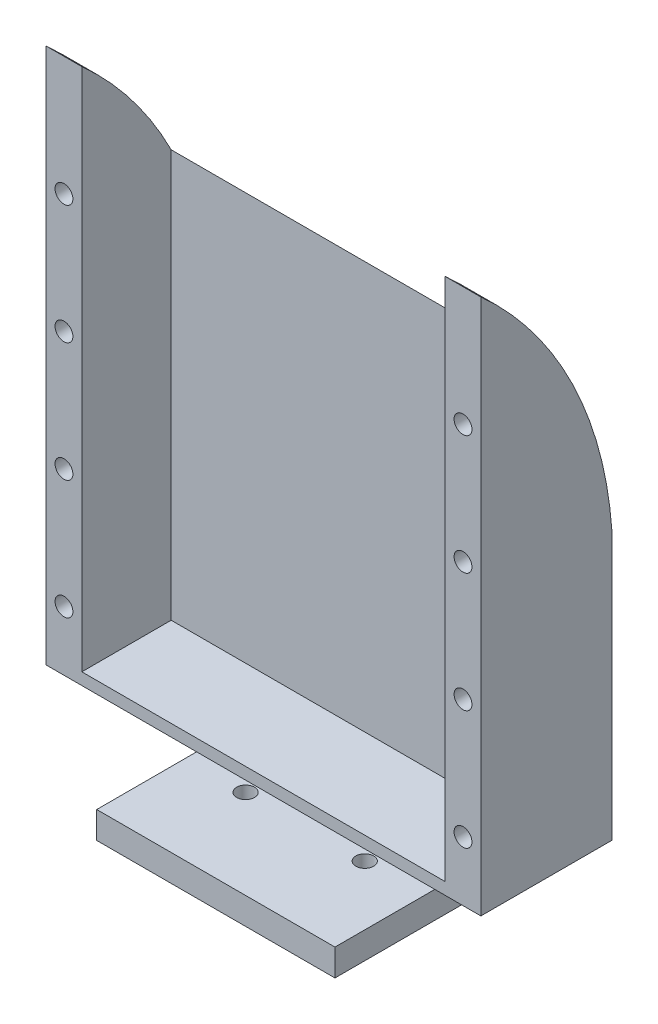
ISO-10303-21;
HEADER;
FILE_DESCRIPTION(('STEP AP214'),'2;1');
FILE_NAME('part.step','',(''),(''),'','','');
FILE_SCHEMA(('AUTOMOTIVE_DESIGN { 1 0 10303 214 1 1 1 1 }'));
ENDSEC;
DATA;
#1=APPLICATION_CONTEXT('core data for automotive mechanical design processes');
#2=APPLICATION_PROTOCOL_DEFINITION('international standard','automotive_design',2000,#1);
#3=PRODUCT_CONTEXT('',#1,'mechanical');
#4=PRODUCT('Part','Part','',(#3));
#5=PRODUCT_RELATED_PRODUCT_CATEGORY('part','',(#4));
#6=PRODUCT_DEFINITION_FORMATION('','',#4);
#7=PRODUCT_DEFINITION_CONTEXT('part definition',#1,'design');
#8=PRODUCT_DEFINITION('design','',#6,#7);
#9=PRODUCT_DEFINITION_SHAPE('','',#8);
#10=(LENGTH_UNIT() NAMED_UNIT(*) SI_UNIT(.MILLI.,.METRE.));
#11=(NAMED_UNIT(*) PLANE_ANGLE_UNIT() SI_UNIT($,.RADIAN.));
#12=(NAMED_UNIT(*) SI_UNIT($,.STERADIAN.) SOLID_ANGLE_UNIT());
#13=UNCERTAINTY_MEASURE_WITH_UNIT(LENGTH_MEASURE(1.E-05),#10,'distance_accuracy_value','');
#14=(GEOMETRIC_REPRESENTATION_CONTEXT(3) GLOBAL_UNCERTAINTY_ASSIGNED_CONTEXT((#13)) GLOBAL_UNIT_ASSIGNED_CONTEXT((#10,
#11,#12)) REPRESENTATION_CONTEXT('',''));
#15=CARTESIAN_POINT('',(0.,0.,0.));
#16=DIRECTION('',(0.,0.,1.));
#17=DIRECTION('',(1.,0.,0.));
#18=AXIS2_PLACEMENT_3D('',#15,#16,#17);
#19=CARTESIAN_POINT('',(0.,0.,-8.));
#20=DIRECTION('',(0.,0.,1.));
#21=DIRECTION('',(1.,0.,0.));
#22=AXIS2_PLACEMENT_3D('',#19,#20,#21);
#23=PLANE('',#22);
#24=CARTESIAN_POINT('',(-10.,8.27,-8.));
#25=DIRECTION('',(0.,0.,1.));
#26=DIRECTION('',(1.,0.,0.));
#27=AXIS2_PLACEMENT_3D('',#24,#25,#26);
#28=CIRCLE('',#27,3.5);
#29=CARTESIAN_POINT('',(-6.5,8.27,-8.));
#30=VERTEX_POINT('',#29);
#31=EDGE_CURVE('E191',#30,#30,#28,.T.);
#32=ORIENTED_EDGE('',*,*,#31,.F.);
#33=EDGE_LOOP('',(#32));
#34=FACE_BOUND('',#33,.T.);
#35=CARTESIAN_POINT('',(10.,8.27,-8.));
#36=DIRECTION('',(0.,0.,1.));
#37=DIRECTION('',(1.,0.,0.));
#38=AXIS2_PLACEMENT_3D('',#35,#36,#37);
#39=CIRCLE('',#38,3.5);
#40=CARTESIAN_POINT('',(13.5,8.27,-8.));
#41=VERTEX_POINT('',#40);
#42=EDGE_CURVE('E186',#41,#41,#39,.T.);
#43=ORIENTED_EDGE('',*,*,#42,.F.);
#44=EDGE_LOOP('',(#43));
#45=FACE_BOUND('',#44,.T.);
#46=DIRECTION('',(0.,-1.,0.));
#47=VECTOR('',#46,1.);
#48=CARTESIAN_POINT('',(20.,4.5,-8.));
#49=LINE('',#48,#47);
#50=CARTESIAN_POINT('',(20.,13.27,-8.));
#51=VERTEX_POINT('',#50);
#52=CARTESIAN_POINT('',(20.,4.5,-8.));
#53=VERTEX_POINT('',#52);
#54=EDGE_CURVE('E207',#51,#53,#49,.T.);
#55=ORIENTED_EDGE('',*,*,#54,.F.);
#56=DIRECTION('',(-1.,0.,0.));
#57=VECTOR('',#56,1.);
#58=CARTESIAN_POINT('',(0.,13.27,-8.));
#59=LINE('',#58,#57);
#60=CARTESIAN_POINT('',(-20.,13.27,-8.));
#61=VERTEX_POINT('',#60);
#62=EDGE_CURVE('E11',#51,#61,#59,.T.);
#63=ORIENTED_EDGE('',*,*,#62,.T.);
#64=DIRECTION('',(0.,1.,0.));
#65=VECTOR('',#64,1.);
#66=CARTESIAN_POINT('',(-20.,4.5,-8.));
#67=LINE('',#66,#65);
#68=CARTESIAN_POINT('',(-20.,4.5,-7.99999999999999));
#69=VERTEX_POINT('',#68);
#70=EDGE_CURVE('E56',#69,#61,#67,.T.);
#71=ORIENTED_EDGE('',*,*,#70,.F.);
#72=DIRECTION('',(-1.,0.,0.));
#73=VECTOR('',#72,1.);
#74=CARTESIAN_POINT('',(20.,4.5,-8.));
#75=LINE('',#74,#73);
#76=EDGE_CURVE('E210',#53,#69,#75,.T.);
#77=ORIENTED_EDGE('',*,*,#76,.F.);
#78=EDGE_LOOP('',(#55,#63,#71,#77));
#79=FACE_BOUND('',#78,.T.);
#80=ADVANCED_FACE('F34',(#34,#45,#79),#23,.T.);
#81=DIRECTION('',(-1.,0.,0.));
#82=VECTOR('',#81,1.);
#83=CARTESIAN_POINT('',(36.5,83.6840511230822,-8.));
#84=LINE('',#83,#82);
#85=CARTESIAN_POINT('',(-30.5,83.6840511230822,-8.));
#86=VERTEX_POINT('',#85);
#87=CARTESIAN_POINT('',(30.5,83.6840511230822,-8.));
#88=VERTEX_POINT('',#87);
#89=EDGE_CURVE('E398',#86,#88,#84,.F.);
#90=ORIENTED_EDGE('',*,*,#89,.F.);
#91=DIRECTION('',(0.,1.,0.));
#92=VECTOR('',#91,1.);
#93=CARTESIAN_POINT('',(-30.5,103.27,-8.));
#94=LINE('',#93,#92);
#95=CARTESIAN_POINT('',(-30.5,15.27,-8.));
#96=VERTEX_POINT('',#95);
#97=EDGE_CURVE('E179',#96,#86,#94,.T.);
#98=ORIENTED_EDGE('',*,*,#97,.F.);
#99=DIRECTION('',(-1.,0.,0.));
#100=VECTOR('',#99,1.);
#101=CARTESIAN_POINT('',(-30.5,15.27,-8.));
#102=LINE('',#101,#100);
#103=CARTESIAN_POINT('',(30.5,15.27,-8.));
#104=VERTEX_POINT('',#103);
#105=EDGE_CURVE('E176',#104,#96,#102,.T.);
#106=ORIENTED_EDGE('',*,*,#105,.F.);
#107=DIRECTION('',(0.,-1.,0.));
#108=VECTOR('',#107,1.);
#109=CARTESIAN_POINT('',(30.5,103.27,-8.));
#110=LINE('',#109,#108);
#111=EDGE_CURVE('E174',#88,#104,#110,.T.);
#112=ORIENTED_EDGE('',*,*,#111,.F.);
#113=EDGE_LOOP('',(#90,#98,#106,#112));
#114=FACE_BOUND('',#113,.T.);
#115=ADVANCED_FACE('F280',(#114),#23,.T.);
#116=CARTESIAN_POINT('',(10.,8.27,-8.));
#117=DIRECTION('',(0.,0.,-1.));
#118=DIRECTION('',(-1.,0.,0.));
#119=AXIS2_PLACEMENT_3D('',#116,#117,#118);
#120=CYLINDRICAL_SURFACE('',#119,1.5);
#121=CARTESIAN_POINT('',(10.,8.27,-15.));
#122=DIRECTION('',(0.,0.,-1.));
#123=DIRECTION('',(-1.,0.,0.));
#124=AXIS2_PLACEMENT_3D('',#121,#122,#123);
#125=CIRCLE('',#124,1.5);
#126=CARTESIAN_POINT('',(8.5,8.27,-15.));
#127=VERTEX_POINT('',#126);
#128=EDGE_CURVE('E202',#127,#127,#125,.T.);
#129=ORIENTED_EDGE('',*,*,#128,.T.);
#130=EDGE_LOOP('',(#129));
#131=FACE_BOUND('',#130,.T.);
#132=CARTESIAN_POINT('',(10.,8.27,-11.));
#133=DIRECTION('',(0.,0.,1.));
#134=DIRECTION('',(1.,0.,0.));
#135=AXIS2_PLACEMENT_3D('',#132,#133,#134);
#136=CIRCLE('',#135,1.5);
#137=CARTESIAN_POINT('',(11.5,8.27,-11.));
#138=VERTEX_POINT('',#137);
#139=EDGE_CURVE('E203',#138,#138,#136,.F.);
#140=ORIENTED_EDGE('',*,*,#139,.F.);
#141=EDGE_LOOP('',(#140));
#142=FACE_BOUND('',#141,.T.);
#143=ADVANCED_FACE('F277',(#131,#142),#120,.F.);
#144=CARTESIAN_POINT('',(-10.,8.27,-8.));
#145=DIRECTION('',(0.,0.,-1.));
#146=DIRECTION('',(-1.,0.,0.));
#147=AXIS2_PLACEMENT_3D('',#144,#145,#146);
#148=CYLINDRICAL_SURFACE('',#147,1.5);
#149=CARTESIAN_POINT('',(-10.,8.27,-15.));
#150=DIRECTION('',(0.,0.,-1.));
#151=DIRECTION('',(-1.,0.,0.));
#152=AXIS2_PLACEMENT_3D('',#149,#150,#151);
#153=CIRCLE('',#152,1.5);
#154=CARTESIAN_POINT('',(-11.5,8.27,-15.));
#155=VERTEX_POINT('',#154);
#156=EDGE_CURVE('E199',#155,#155,#153,.T.);
#157=ORIENTED_EDGE('',*,*,#156,.T.);
#158=EDGE_LOOP('',(#157));
#159=FACE_BOUND('',#158,.T.);
#160=CARTESIAN_POINT('',(-10.,8.27,-11.));
#161=DIRECTION('',(0.,0.,1.));
#162=DIRECTION('',(1.,0.,0.));
#163=AXIS2_PLACEMENT_3D('',#160,#161,#162);
#164=CIRCLE('',#163,1.5);
#165=CARTESIAN_POINT('',(-8.5,8.27,-11.));
#166=VERTEX_POINT('',#165);
#167=EDGE_CURVE('E190',#166,#166,#164,.F.);
#168=ORIENTED_EDGE('',*,*,#167,.F.);
#169=EDGE_LOOP('',(#168));
#170=FACE_BOUND('',#169,.T.);
#171=ADVANCED_FACE('F279',(#159,#170),#148,.F.);
#172=CARTESIAN_POINT('',(0.,4.5,0.));
#173=DIRECTION('',(0.,-1.,0.));
#174=DIRECTION('',(0.,0.,-1.));
#175=AXIS2_PLACEMENT_3D('',#172,#173,#174);
#176=PLANE('',#175);
#177=DIRECTION('',(0.,0.,-1.));
#178=VECTOR('',#177,1.);
#179=CARTESIAN_POINT('',(20.,4.5,15.));
#180=LINE('',#179,#178);
#181=CARTESIAN_POINT('',(20.,4.5,15.));
#182=VERTEX_POINT('',#181);
#183=EDGE_CURVE('E245',#182,#53,#180,.T.);
#184=ORIENTED_EDGE('',*,*,#183,.T.);
#185=ORIENTED_EDGE('',*,*,#76,.T.);
#186=DIRECTION('',(0.,0.,1.));
#187=VECTOR('',#186,1.);
#188=CARTESIAN_POINT('',(-20.,4.5,15.));
#189=LINE('',#188,#187);
#190=CARTESIAN_POINT('',(-20.,4.5,15.));
#191=VERTEX_POINT('',#190);
#192=EDGE_CURVE('E248',#69,#191,#189,.T.);
#193=ORIENTED_EDGE('',*,*,#192,.T.);
#194=DIRECTION('',(1.,0.,0.));
#195=VECTOR('',#194,1.);
#196=CARTESIAN_POINT('',(-20.,4.5,15.));
#197=LINE('',#196,#195);
#198=EDGE_CURVE('E251',#191,#182,#197,.T.);
#199=ORIENTED_EDGE('',*,*,#198,.T.);
#200=EDGE_LOOP('',(#184,#185,#193,#199));
#201=FACE_BOUND('',#200,.T.);
#202=CARTESIAN_POINT('',(-10.,4.5,0.));
#203=DIRECTION('',(0.,1.,0.));
#204=DIRECTION('',(0.,0.,1.));
#205=AXIS2_PLACEMENT_3D('',#202,#203,#204);
#206=CIRCLE('',#205,1.5);
#207=CARTESIAN_POINT('',(-10.,4.5,1.5));
#208=VERTEX_POINT('',#207);
#209=EDGE_CURVE('E239',#208,#208,#206,.T.);
#210=ORIENTED_EDGE('',*,*,#209,.F.);
#211=EDGE_LOOP('',(#210));
#212=FACE_BOUND('',#211,.T.);
#213=CARTESIAN_POINT('',(9.99999999999999,4.5,0.));
#214=DIRECTION('',(0.,1.,0.));
#215=DIRECTION('',(0.,0.,1.));
#216=AXIS2_PLACEMENT_3D('',#213,#214,#215);
#217=CIRCLE('',#216,1.5);
#218=CARTESIAN_POINT('',(9.99999999999999,4.5,1.5));
#219=VERTEX_POINT('',#218);
#220=EDGE_CURVE('E233',#219,#219,#217,.T.);
#221=ORIENTED_EDGE('',*,*,#220,.F.);
#222=EDGE_LOOP('',(#221));
#223=FACE_BOUND('',#222,.T.);
#224=ADVANCED_FACE('F287',(#201,#212,#223),#176,.F.);
#225=CARTESIAN_POINT('',(0.,0.,0.));
#226=DIRECTION('',(0.,-1.,0.));
#227=DIRECTION('',(0.,0.,-1.));
#228=AXIS2_PLACEMENT_3D('',#225,#226,#227);
#229=PLANE('',#228);
#230=CARTESIAN_POINT('',(-10.,0.,0.));
#231=DIRECTION('',(0.,1.,0.));
#232=DIRECTION('',(0.,0.,1.));
#233=AXIS2_PLACEMENT_3D('',#230,#231,#232);
#234=CIRCLE('',#233,1.5);
#235=CARTESIAN_POINT('',(-10.,0.,1.5));
#236=VERTEX_POINT('',#235);
#237=EDGE_CURVE('E236',#236,#236,#234,.T.);
#238=ORIENTED_EDGE('',*,*,#237,.T.);
#239=EDGE_LOOP('',(#238));
#240=FACE_BOUND('',#239,.T.);
#241=DIRECTION('',(0.,0.,-1.));
#242=VECTOR('',#241,1.);
#243=CARTESIAN_POINT('',(20.,0.,15.));
#244=LINE('',#243,#242);
#245=CARTESIAN_POINT('',(20.,0.,15.));
#246=VERTEX_POINT('',#245);
#247=CARTESIAN_POINT('',(20.,0.,-15.));
#248=VERTEX_POINT('',#247);
#249=EDGE_CURVE('E242',#246,#248,#244,.T.);
#250=ORIENTED_EDGE('',*,*,#249,.F.);
#251=DIRECTION('',(1.,0.,0.));
#252=VECTOR('',#251,1.);
#253=CARTESIAN_POINT('',(-20.,0.,15.));
#254=LINE('',#253,#252);
#255=CARTESIAN_POINT('',(-20.,0.,15.));
#256=VERTEX_POINT('',#255);
#257=EDGE_CURVE('E249',#256,#246,#254,.T.);
#258=ORIENTED_EDGE('',*,*,#257,.F.);
#259=DIRECTION('',(0.,0.,1.));
#260=VECTOR('',#259,1.);
#261=CARTESIAN_POINT('',(-20.,0.,15.));
#262=LINE('',#261,#260);
#263=CARTESIAN_POINT('',(-20.,0.,-15.));
#264=VERTEX_POINT('',#263);
#265=EDGE_CURVE('E258',#264,#256,#262,.T.);
#266=ORIENTED_EDGE('',*,*,#265,.F.);
#267=DIRECTION('',(-1.,0.,0.));
#268=VECTOR('',#267,1.);
#269=CARTESIAN_POINT('',(-20.,0.,-15.));
#270=LINE('',#269,#268);
#271=EDGE_CURVE('E256',#248,#264,#270,.T.);
#272=ORIENTED_EDGE('',*,*,#271,.F.);
#273=EDGE_LOOP('',(#250,#258,#266,#272));
#274=FACE_BOUND('',#273,.T.);
#275=CARTESIAN_POINT('',(9.99999999999999,0.,0.));
#276=DIRECTION('',(0.,1.,0.));
#277=DIRECTION('',(0.,0.,1.));
#278=AXIS2_PLACEMENT_3D('',#275,#276,#277);
#279=CIRCLE('',#278,1.5);
#280=CARTESIAN_POINT('',(9.99999999999999,0.,1.5));
#281=VERTEX_POINT('',#280);
#282=EDGE_CURVE('E225',#281,#281,#279,.T.);
#283=ORIENTED_EDGE('',*,*,#282,.T.);
#284=EDGE_LOOP('',(#283));
#285=FACE_BOUND('',#284,.T.);
#286=ADVANCED_FACE('F321',(#240,#274,#285),#229,.T.);
#287=CARTESIAN_POINT('',(20.,4.5,15.));
#288=DIRECTION('',(-1.,0.,0.));
#289=DIRECTION('',(0.,0.,1.));
#290=AXIS2_PLACEMENT_3D('',#287,#288,#289);
#291=PLANE('',#290);
#292=ORIENTED_EDGE('',*,*,#249,.T.);
#293=DIRECTION('',(0.,-1.,0.));
#294=VECTOR('',#293,1.);
#295=CARTESIAN_POINT('',(20.,4.5,-15.));
#296=LINE('',#295,#294);
#297=CARTESIAN_POINT('',(20.,13.27,-15.));
#298=VERTEX_POINT('',#297);
#299=EDGE_CURVE('E42',#298,#248,#296,.T.);
#300=ORIENTED_EDGE('',*,*,#299,.F.);
#301=DIRECTION('',(0.,0.,-1.));
#302=VECTOR('',#301,1.);
#303=CARTESIAN_POINT('',(20.,13.27,-8.));
#304=LINE('',#303,#302);
#305=EDGE_CURVE('E229',#51,#298,#304,.T.);
#306=ORIENTED_EDGE('',*,*,#305,.F.);
#307=ORIENTED_EDGE('',*,*,#54,.T.);
#308=ORIENTED_EDGE('',*,*,#183,.F.);
#309=DIRECTION('',(0.,-1.,0.));
#310=VECTOR('',#309,1.);
#311=CARTESIAN_POINT('',(20.,4.5,15.));
#312=LINE('',#311,#310);
#313=EDGE_CURVE('E253',#182,#246,#312,.T.);
#314=ORIENTED_EDGE('',*,*,#313,.T.);
#315=EDGE_LOOP('',(#292,#300,#306,#307,#308,#314));
#316=FACE_BOUND('',#315,.T.);
#317=ADVANCED_FACE('F36',(#316),#291,.F.);
#318=CARTESIAN_POINT('',(-20.,4.5,-15.));
#319=DIRECTION('',(0.,0.,1.));
#320=DIRECTION('',(1.,0.,0.));
#321=AXIS2_PLACEMENT_3D('',#318,#319,#320);
#322=PLANE('',#321);
#323=DIRECTION('',(0.,1.,0.));
#324=VECTOR('',#323,1.);
#325=CARTESIAN_POINT('',(-36.5,13.27,-15.));
#326=LINE('',#325,#324);
#327=CARTESIAN_POINT('',(-36.5,13.27,-15.));
#328=VERTEX_POINT('',#327);
#329=CARTESIAN_POINT('',(-36.5,58.27,-15.));
#330=VERTEX_POINT('',#329);
#331=EDGE_CURVE('E206',#328,#330,#326,.T.);
#332=ORIENTED_EDGE('',*,*,#331,.T.);
#333=DIRECTION('',(-1.,0.,0.));
#334=VECTOR('',#333,1.);
#335=CARTESIAN_POINT('',(36.5,58.27,-15.));
#336=LINE('',#335,#334);
#337=CARTESIAN_POINT('',(36.5,58.27,-15.));
#338=VERTEX_POINT('',#337);
#339=EDGE_CURVE('E154',#338,#330,#336,.T.);
#340=ORIENTED_EDGE('',*,*,#339,.F.);
#341=DIRECTION('',(0.,-1.,0.));
#342=VECTOR('',#341,1.);
#343=CARTESIAN_POINT('',(36.5,13.27,-15.));
#344=LINE('',#343,#342);
#345=CARTESIAN_POINT('',(36.5,13.27,-15.));
#346=VERTEX_POINT('',#345);
#347=EDGE_CURVE('E153',#338,#346,#344,.T.);
#348=ORIENTED_EDGE('',*,*,#347,.T.);
#349=DIRECTION('',(-1.,0.,0.));
#350=VECTOR('',#349,1.);
#351=CARTESIAN_POINT('',(36.5,13.27,-15.));
#352=LINE('',#351,#350);
#353=EDGE_CURVE('E218',#346,#298,#352,.T.);
#354=ORIENTED_EDGE('',*,*,#353,.T.);
#355=ORIENTED_EDGE('',*,*,#299,.T.);
#356=ORIENTED_EDGE('',*,*,#271,.T.);
#357=DIRECTION('',(0.,-1.,0.));
#358=VECTOR('',#357,1.);
#359=CARTESIAN_POINT('',(-20.,4.5,-15.));
#360=LINE('',#359,#358);
#361=CARTESIAN_POINT('',(-20.,13.27,-15.));
#362=VERTEX_POINT('',#361);
#363=EDGE_CURVE('E266',#362,#264,#360,.T.);
#364=ORIENTED_EDGE('',*,*,#363,.F.);
#365=DIRECTION('',(-1.,0.,0.));
#366=VECTOR('',#365,1.);
#367=CARTESIAN_POINT('',(-20.,13.27,-15.));
#368=LINE('',#367,#366);
#369=EDGE_CURVE('E211',#362,#328,#368,.T.);
#370=ORIENTED_EDGE('',*,*,#369,.T.);
#371=EDGE_LOOP('',(#332,#340,#348,#354,#355,#356,#364,#370));
#372=FACE_BOUND('',#371,.T.);
#373=ORIENTED_EDGE('',*,*,#156,.F.);
#374=EDGE_LOOP('',(#373));
#375=FACE_BOUND('',#374,.T.);
#376=ORIENTED_EDGE('',*,*,#128,.F.);
#377=EDGE_LOOP('',(#376));
#378=FACE_BOUND('',#377,.T.);
#379=ADVANCED_FACE('F331',(#372,#375,#378),#322,.F.);
#380=CARTESIAN_POINT('',(-20.,4.5,15.));
#381=DIRECTION('',(1.,0.,0.));
#382=DIRECTION('',(0.,0.,-1.));
#383=AXIS2_PLACEMENT_3D('',#380,#381,#382);
#384=PLANE('',#383);
#385=ORIENTED_EDGE('',*,*,#265,.T.);
#386=DIRECTION('',(0.,-1.,0.));
#387=VECTOR('',#386,1.);
#388=CARTESIAN_POINT('',(-20.,4.5,15.));
#389=LINE('',#388,#387);
#390=EDGE_CURVE('E263',#191,#256,#389,.T.);
#391=ORIENTED_EDGE('',*,*,#390,.F.);
#392=ORIENTED_EDGE('',*,*,#192,.F.);
#393=ORIENTED_EDGE('',*,*,#70,.T.);
#394=DIRECTION('',(0.,0.,-1.));
#395=VECTOR('',#394,1.);
#396=CARTESIAN_POINT('',(-20.,13.27,-8.));
#397=LINE('',#396,#395);
#398=EDGE_CURVE('E226',#61,#362,#397,.T.);
#399=ORIENTED_EDGE('',*,*,#398,.T.);
#400=ORIENTED_EDGE('',*,*,#363,.T.);
#401=EDGE_LOOP('',(#385,#391,#392,#393,#399,#400));
#402=FACE_BOUND('',#401,.T.);
#403=ADVANCED_FACE('F328',(#402),#384,.F.);
#404=CARTESIAN_POINT('',(-20.,4.5,15.));
#405=DIRECTION('',(0.,0.,-1.));
#406=DIRECTION('',(-1.,0.,0.));
#407=AXIS2_PLACEMENT_3D('',#404,#405,#406);
#408=PLANE('',#407);
#409=ORIENTED_EDGE('',*,*,#257,.T.);
#410=ORIENTED_EDGE('',*,*,#313,.F.);
#411=ORIENTED_EDGE('',*,*,#198,.F.);
#412=ORIENTED_EDGE('',*,*,#390,.T.);
#413=EDGE_LOOP('',(#409,#410,#411,#412));
#414=FACE_BOUND('',#413,.T.);
#415=ADVANCED_FACE('F317',(#414),#408,.F.);
#416=CARTESIAN_POINT('',(-10.,4.5,0.));
#417=DIRECTION('',(0.,-1.,0.));
#418=DIRECTION('',(0.,0.,-1.));
#419=AXIS2_PLACEMENT_3D('',#416,#417,#418);
#420=CYLINDRICAL_SURFACE('',#419,1.5);
#421=ORIENTED_EDGE('',*,*,#209,.T.);
#422=EDGE_LOOP('',(#421));
#423=FACE_BOUND('',#422,.T.);
#424=ORIENTED_EDGE('',*,*,#237,.F.);
#425=EDGE_LOOP('',(#424));
#426=FACE_BOUND('',#425,.T.);
#427=ADVANCED_FACE('F313',(#423,#426),#420,.F.);
#428=CARTESIAN_POINT('',(9.99999999999999,4.5,0.));
#429=DIRECTION('',(0.,-1.,0.));
#430=DIRECTION('',(0.,0.,-1.));
#431=AXIS2_PLACEMENT_3D('',#428,#429,#430);
#432=CYLINDRICAL_SURFACE('',#431,1.5);
#433=ORIENTED_EDGE('',*,*,#220,.T.);
#434=EDGE_LOOP('',(#433));
#435=FACE_BOUND('',#434,.T.);
#436=ORIENTED_EDGE('',*,*,#282,.F.);
#437=EDGE_LOOP('',(#436));
#438=FACE_BOUND('',#437,.T.);
#439=ADVANCED_FACE('F309',(#435,#438),#432,.F.);
#440=CARTESIAN_POINT('',(-36.5,13.27,-8.));
#441=DIRECTION('',(-1.,0.,0.));
#442=DIRECTION('',(0.,0.,1.));
#443=AXIS2_PLACEMENT_3D('',#440,#441,#442);
#444=PLANE('',#443);
#445=CARTESIAN_POINT('',(-36.5,53.6086172597643,51.5573737868457));
#446=DIRECTION('',(1.,0.,0.));
#447=DIRECTION('',(0.,0.,1.));
#448=AXIS2_PLACEMENT_3D('',#445,#446,#447);
#449=CIRCLE('',#448,66.7204053828577);
#450=CARTESIAN_POINT('',(-36.5,103.27,7.));
#451=VERTEX_POINT('',#450);
#452=EDGE_CURVE('E155',#330,#451,#449,.T.);
#453=ORIENTED_EDGE('',*,*,#452,.F.);
#454=ORIENTED_EDGE('',*,*,#331,.F.);
#455=DIRECTION('',(0.,0.,-1.));
#456=VECTOR('',#455,1.);
#457=CARTESIAN_POINT('',(-36.5,13.27,-8.));
#458=LINE('',#457,#456);
#459=CARTESIAN_POINT('',(-36.5,13.27,7.));
#460=VERTEX_POINT('',#459);
#461=EDGE_CURVE('E223',#460,#328,#458,.T.);
#462=ORIENTED_EDGE('',*,*,#461,.F.);
#463=DIRECTION('',(0.,-1.,0.));
#464=VECTOR('',#463,1.);
#465=CARTESIAN_POINT('',(-36.5,103.27,7.));
#466=LINE('',#465,#464);
#467=EDGE_CURVE('E164',#451,#460,#466,.T.);
#468=ORIENTED_EDGE('',*,*,#467,.F.);
#469=EDGE_LOOP('',(#453,#454,#462,#468));
#470=FACE_BOUND('',#469,.T.);
#471=ADVANCED_FACE('F302',(#470),#444,.T.);
#472=CARTESIAN_POINT('',(-20.,13.27,-8.));
#473=DIRECTION('',(0.,-1.,0.));
#474=DIRECTION('',(1.,0.,0.));
#475=AXIS2_PLACEMENT_3D('',#472,#473,#474);
#476=PLANE('',#475);
#477=ORIENTED_EDGE('',*,*,#369,.F.);
#478=ORIENTED_EDGE('',*,*,#398,.F.);
#479=ORIENTED_EDGE('',*,*,#62,.F.);
#480=ORIENTED_EDGE('',*,*,#305,.T.);
#481=ORIENTED_EDGE('',*,*,#353,.F.);
#482=DIRECTION('',(0.,0.,-1.));
#483=VECTOR('',#482,1.);
#484=CARTESIAN_POINT('',(36.5,13.27,-8.));
#485=LINE('',#484,#483);
#486=CARTESIAN_POINT('',(36.5,13.27,7.));
#487=VERTEX_POINT('',#486);
#488=EDGE_CURVE('E214',#487,#346,#485,.T.);
#489=ORIENTED_EDGE('',*,*,#488,.F.);
#490=DIRECTION('',(1.,0.,0.));
#491=VECTOR('',#490,1.);
#492=CARTESIAN_POINT('',(-36.5,13.27,7.));
#493=LINE('',#492,#491);
#494=EDGE_CURVE('E162',#460,#487,#493,.T.);
#495=ORIENTED_EDGE('',*,*,#494,.F.);
#496=ORIENTED_EDGE('',*,*,#461,.T.);
#497=EDGE_LOOP('',(#477,#478,#479,#480,#481,#489,#495,#496));
#498=FACE_BOUND('',#497,.T.);
#499=ADVANCED_FACE('F299',(#498),#476,.T.);
#500=CARTESIAN_POINT('',(36.5,13.27,-8.));
#501=DIRECTION('',(1.,0.,0.));
#502=DIRECTION('',(0.,1.,0.));
#503=AXIS2_PLACEMENT_3D('',#500,#501,#502);
#504=PLANE('',#503);
#505=CARTESIAN_POINT('',(36.5,53.6086172597643,51.5573737868457));
#506=DIRECTION('',(1.,0.,0.));
#507=DIRECTION('',(0.,0.,1.));
#508=AXIS2_PLACEMENT_3D('',#505,#506,#507);
#509=CIRCLE('',#508,66.7204053828577);
#510=CARTESIAN_POINT('',(36.5,103.27,7.));
#511=VERTEX_POINT('',#510);
#512=EDGE_CURVE('E138',#338,#511,#509,.T.);
#513=ORIENTED_EDGE('',*,*,#512,.T.);
#514=DIRECTION('',(0.,1.,0.));
#515=VECTOR('',#514,1.);
#516=CARTESIAN_POINT('',(36.5,13.27,7.));
#517=LINE('',#516,#515);
#518=EDGE_CURVE('E146',#487,#511,#517,.T.);
#519=ORIENTED_EDGE('',*,*,#518,.F.);
#520=ORIENTED_EDGE('',*,*,#488,.T.);
#521=ORIENTED_EDGE('',*,*,#347,.F.);
#522=EDGE_LOOP('',(#513,#519,#520,#521));
#523=FACE_BOUND('',#522,.T.);
#524=ADVANCED_FACE('F151',(#523),#504,.T.);
#525=CARTESIAN_POINT('',(-10.,8.27,-11.));
#526=DIRECTION('',(0.,0.,1.));
#527=DIRECTION('',(1.,0.,0.));
#528=AXIS2_PLACEMENT_3D('',#525,#526,#527);
#529=PLANE('',#528);
#530=CARTESIAN_POINT('',(-10.,8.27,-11.));
#531=DIRECTION('',(0.,0.,1.));
#532=DIRECTION('',(1.,0.,0.));
#533=AXIS2_PLACEMENT_3D('',#530,#531,#532);
#534=CIRCLE('',#533,3.5);
#535=CARTESIAN_POINT('',(-6.5,8.27,-11.));
#536=VERTEX_POINT('',#535);
#537=EDGE_CURVE('E187',#536,#536,#534,.T.);
#538=ORIENTED_EDGE('',*,*,#537,.T.);
#539=EDGE_LOOP('',(#538));
#540=FACE_BOUND('',#539,.T.);
#541=ORIENTED_EDGE('',*,*,#167,.T.);
#542=EDGE_LOOP('',(#541));
#543=FACE_BOUND('',#542,.T.);
#544=ADVANCED_FACE('F306',(#540,#543),#529,.T.);
#545=CARTESIAN_POINT('',(-10.,8.27,-11.));
#546=DIRECTION('',(0.,0.,1.));
#547=DIRECTION('',(1.,0.,0.));
#548=AXIS2_PLACEMENT_3D('',#545,#546,#547);
#549=CYLINDRICAL_SURFACE('',#548,3.5);
#550=ORIENTED_EDGE('',*,*,#537,.F.);
#551=EDGE_LOOP('',(#550));
#552=FACE_BOUND('',#551,.T.);
#553=ORIENTED_EDGE('',*,*,#31,.T.);
#554=EDGE_LOOP('',(#553));
#555=FACE_BOUND('',#554,.T.);
#556=ADVANCED_FACE('F348',(#552,#555),#549,.F.);
#557=CARTESIAN_POINT('',(10.,8.27,-11.));
#558=DIRECTION('',(0.,0.,1.));
#559=DIRECTION('',(1.,0.,0.));
#560=AXIS2_PLACEMENT_3D('',#557,#558,#559);
#561=PLANE('',#560);
#562=CARTESIAN_POINT('',(10.,8.27,-11.));
#563=DIRECTION('',(0.,0.,1.));
#564=DIRECTION('',(1.,0.,0.));
#565=AXIS2_PLACEMENT_3D('',#562,#563,#564);
#566=CIRCLE('',#565,3.5);
#567=CARTESIAN_POINT('',(13.5,8.27,-11.));
#568=VERTEX_POINT('',#567);
#569=EDGE_CURVE('E194',#568,#568,#566,.T.);
#570=ORIENTED_EDGE('',*,*,#569,.T.);
#571=EDGE_LOOP('',(#570));
#572=FACE_BOUND('',#571,.T.);
#573=ORIENTED_EDGE('',*,*,#139,.T.);
#574=EDGE_LOOP('',(#573));
#575=FACE_BOUND('',#574,.T.);
#576=ADVANCED_FACE('F275',(#572,#575),#561,.T.);
#577=CARTESIAN_POINT('',(10.,8.27,-11.));
#578=DIRECTION('',(0.,0.,1.));
#579=DIRECTION('',(1.,0.,0.));
#580=AXIS2_PLACEMENT_3D('',#577,#578,#579);
#581=CYLINDRICAL_SURFACE('',#580,3.5);
#582=ORIENTED_EDGE('',*,*,#569,.F.);
#583=EDGE_LOOP('',(#582));
#584=FACE_BOUND('',#583,.T.);
#585=ORIENTED_EDGE('',*,*,#42,.T.);
#586=EDGE_LOOP('',(#585));
#587=FACE_BOUND('',#586,.T.);
#588=ADVANCED_FACE('F362',(#584,#587),#581,.F.);
#589=CARTESIAN_POINT('',(30.5,103.27,7.));
#590=DIRECTION('',(1.,0.,0.));
#591=DIRECTION('',(0.,1.,0.));
#592=AXIS2_PLACEMENT_3D('',#589,#590,#591);
#593=PLANE('',#592);
#594=DIRECTION('',(0.,-1.,0.));
#595=VECTOR('',#594,1.);
#596=CARTESIAN_POINT('',(30.5,103.27,7.));
#597=LINE('',#596,#595);
#598=CARTESIAN_POINT('',(30.5,103.27,7.));
#599=VERTEX_POINT('',#598);
#600=CARTESIAN_POINT('',(30.5,15.27,7.));
#601=VERTEX_POINT('',#600);
#602=EDGE_CURVE('E145',#599,#601,#597,.T.);
#603=ORIENTED_EDGE('',*,*,#602,.F.);
#604=CARTESIAN_POINT('',(30.5,53.6086172597643,51.5573737868457));
#605=DIRECTION('',(1.,0.,0.));
#606=DIRECTION('',(0.,1.,0.));
#607=AXIS2_PLACEMENT_3D('',#604,#605,#606);
#608=CIRCLE('',#607,66.7204053828577);
#609=EDGE_CURVE('E141',#599,#88,#608,.F.);
#610=ORIENTED_EDGE('',*,*,#609,.T.);
#611=ORIENTED_EDGE('',*,*,#111,.T.);
#612=DIRECTION('',(0.,0.,-1.));
#613=VECTOR('',#612,1.);
#614=CARTESIAN_POINT('',(30.5,15.27,7.));
#615=LINE('',#614,#613);
#616=EDGE_CURVE('E183',#601,#104,#615,.T.);
#617=ORIENTED_EDGE('',*,*,#616,.F.);
#618=EDGE_LOOP('',(#603,#610,#611,#617));
#619=FACE_BOUND('',#618,.T.);
#620=ADVANCED_FACE('F357',(#619),#593,.F.);
#621=CARTESIAN_POINT('',(-30.5,15.27,7.));
#622=DIRECTION('',(0.,-1.,0.));
#623=DIRECTION('',(0.,0.,-1.));
#624=AXIS2_PLACEMENT_3D('',#621,#622,#623);
#625=PLANE('',#624);
#626=ORIENTED_EDGE('',*,*,#105,.T.);
#627=DIRECTION('',(0.,0.,-1.));
#628=VECTOR('',#627,1.);
#629=CARTESIAN_POINT('',(-30.5,15.27,7.));
#630=LINE('',#629,#628);
#631=CARTESIAN_POINT('',(-30.5,15.27,7.));
#632=VERTEX_POINT('',#631);
#633=EDGE_CURVE('E49',#632,#96,#630,.T.);
#634=ORIENTED_EDGE('',*,*,#633,.F.);
#635=DIRECTION('',(-1.,0.,0.));
#636=VECTOR('',#635,1.);
#637=CARTESIAN_POINT('',(-30.5,15.27,7.));
#638=LINE('',#637,#636);
#639=EDGE_CURVE('E169',#601,#632,#638,.T.);
#640=ORIENTED_EDGE('',*,*,#639,.F.);
#641=ORIENTED_EDGE('',*,*,#616,.T.);
#642=EDGE_LOOP('',(#626,#634,#640,#641));
#643=FACE_BOUND('',#642,.T.);
#644=ADVANCED_FACE('F369',(#643),#625,.F.);
#645=CARTESIAN_POINT('',(-30.5,103.27,7.));
#646=DIRECTION('',(-1.,0.,0.));
#647=DIRECTION('',(0.,-1.,0.));
#648=AXIS2_PLACEMENT_3D('',#645,#646,#647);
#649=PLANE('',#648);
#650=ORIENTED_EDGE('',*,*,#97,.T.);
#651=CARTESIAN_POINT('',(-30.5,53.6086172597643,51.5573737868457));
#652=DIRECTION('',(-1.,0.,0.));
#653=DIRECTION('',(0.,-1.,0.));
#654=AXIS2_PLACEMENT_3D('',#651,#652,#653);
#655=CIRCLE('',#654,66.7204053828577);
#656=CARTESIAN_POINT('',(-30.5,103.27,7.));
#657=VERTEX_POINT('',#656);
#658=EDGE_CURVE('E395',#86,#657,#655,.F.);
#659=ORIENTED_EDGE('',*,*,#658,.T.);
#660=DIRECTION('',(0.,1.,0.));
#661=VECTOR('',#660,1.);
#662=CARTESIAN_POINT('',(-30.5,103.27,7.));
#663=LINE('',#662,#661);
#664=EDGE_CURVE('E171',#632,#657,#663,.T.);
#665=ORIENTED_EDGE('',*,*,#664,.F.);
#666=ORIENTED_EDGE('',*,*,#633,.T.);
#667=EDGE_LOOP('',(#650,#659,#665,#666));
#668=FACE_BOUND('',#667,.T.);
#669=ADVANCED_FACE('F449',(#668),#649,.F.);
#670=CARTESIAN_POINT('',(0.,0.,7.));
#671=DIRECTION('',(0.,0.,-1.));
#672=DIRECTION('',(-1.,0.,0.));
#673=AXIS2_PLACEMENT_3D('',#670,#671,#672);
#674=PLANE('',#673);
#675=CARTESIAN_POINT('',(-33.5,63.27,7.));
#676=DIRECTION('',(0.,0.,1.));
#677=DIRECTION('',(1.,0.,0.));
#678=AXIS2_PLACEMENT_3D('',#675,#676,#677);
#679=CIRCLE('',#678,1.5);
#680=CARTESIAN_POINT('',(-32.,63.27,7.));
#681=VERTEX_POINT('',#680);
#682=EDGE_CURVE('E424',#681,#681,#679,.T.);
#683=ORIENTED_EDGE('',*,*,#682,.F.);
#684=EDGE_LOOP('',(#683));
#685=FACE_BOUND('',#684,.T.);
#686=CARTESIAN_POINT('',(-33.5,43.27,7.));
#687=DIRECTION('',(0.,0.,1.));
#688=DIRECTION('',(1.,0.,0.));
#689=AXIS2_PLACEMENT_3D('',#686,#687,#688);
#690=CIRCLE('',#689,1.5);
#691=CARTESIAN_POINT('',(-32.,43.27,7.));
#692=VERTEX_POINT('',#691);
#693=EDGE_CURVE('E430',#692,#692,#690,.T.);
#694=ORIENTED_EDGE('',*,*,#693,.F.);
#695=EDGE_LOOP('',(#694));
#696=FACE_BOUND('',#695,.T.);
#697=CARTESIAN_POINT('',(33.5,23.27,7.));
#698=DIRECTION('',(0.,0.,1.));
#699=DIRECTION('',(-1.,0.,0.));
#700=AXIS2_PLACEMENT_3D('',#697,#698,#699);
#701=CIRCLE('',#700,1.5);
#702=CARTESIAN_POINT('',(32.,23.27,7.));
#703=VERTEX_POINT('',#702);
#704=EDGE_CURVE('E436',#703,#703,#701,.T.);
#705=ORIENTED_EDGE('',*,*,#704,.F.);
#706=EDGE_LOOP('',(#705));
#707=FACE_BOUND('',#706,.T.);
#708=CARTESIAN_POINT('',(33.5,43.27,7.));
#709=DIRECTION('',(0.,0.,1.));
#710=DIRECTION('',(-1.,0.,0.));
#711=AXIS2_PLACEMENT_3D('',#708,#709,#710);
#712=CIRCLE('',#711,1.5);
#713=CARTESIAN_POINT('',(32.,43.27,7.));
#714=VERTEX_POINT('',#713);
#715=EDGE_CURVE('E405',#714,#714,#712,.T.);
#716=ORIENTED_EDGE('',*,*,#715,.F.);
#717=EDGE_LOOP('',(#716));
#718=FACE_BOUND('',#717,.T.);
#719=CARTESIAN_POINT('',(33.5,63.27,7.));
#720=DIRECTION('',(0.,0.,1.));
#721=DIRECTION('',(-1.,0.,0.));
#722=AXIS2_PLACEMENT_3D('',#719,#720,#721);
#723=CIRCLE('',#722,1.5);
#724=CARTESIAN_POINT('',(32.,63.27,7.));
#725=VERTEX_POINT('',#724);
#726=EDGE_CURVE('E406',#725,#725,#723,.T.);
#727=ORIENTED_EDGE('',*,*,#726,.F.);
#728=EDGE_LOOP('',(#727));
#729=FACE_BOUND('',#728,.T.);
#730=CARTESIAN_POINT('',(33.5,83.27,7.));
#731=DIRECTION('',(0.,0.,1.));
#732=DIRECTION('',(-1.,0.,0.));
#733=AXIS2_PLACEMENT_3D('',#730,#731,#732);
#734=CIRCLE('',#733,1.5);
#735=CARTESIAN_POINT('',(32.,83.27,7.));
#736=VERTEX_POINT('',#735);
#737=EDGE_CURVE('E412',#736,#736,#734,.T.);
#738=ORIENTED_EDGE('',*,*,#737,.F.);
#739=EDGE_LOOP('',(#738));
#740=FACE_BOUND('',#739,.T.);
#741=CARTESIAN_POINT('',(-33.5,23.27,7.));
#742=DIRECTION('',(0.,0.,1.));
#743=DIRECTION('',(1.,0.,0.));
#744=AXIS2_PLACEMENT_3D('',#741,#742,#743);
#745=CIRCLE('',#744,1.5);
#746=CARTESIAN_POINT('',(-32.,23.27,7.));
#747=VERTEX_POINT('',#746);
#748=EDGE_CURVE('E401',#747,#747,#745,.T.);
#749=ORIENTED_EDGE('',*,*,#748,.F.);
#750=EDGE_LOOP('',(#749));
#751=FACE_BOUND('',#750,.T.);
#752=CARTESIAN_POINT('',(-33.5,83.27,7.));
#753=DIRECTION('',(0.,0.,1.));
#754=DIRECTION('',(1.,0.,0.));
#755=AXIS2_PLACEMENT_3D('',#752,#753,#754);
#756=CIRCLE('',#755,1.5);
#757=CARTESIAN_POINT('',(-32.,83.27,7.));
#758=VERTEX_POINT('',#757);
#759=EDGE_CURVE('E423',#758,#758,#756,.T.);
#760=ORIENTED_EDGE('',*,*,#759,.F.);
#761=EDGE_LOOP('',(#760));
#762=FACE_BOUND('',#761,.T.);
#763=DIRECTION('',(-1.,0.,0.));
#764=VECTOR('',#763,1.);
#765=CARTESIAN_POINT('',(-36.5,103.27,7.));
#766=LINE('',#765,#764);
#767=EDGE_CURVE('E181',#657,#451,#766,.T.);
#768=ORIENTED_EDGE('',*,*,#767,.T.);
#769=ORIENTED_EDGE('',*,*,#467,.T.);
#770=ORIENTED_EDGE('',*,*,#494,.T.);
#771=ORIENTED_EDGE('',*,*,#518,.T.);
#772=DIRECTION('',(-1.,0.,0.));
#773=VECTOR('',#772,1.);
#774=CARTESIAN_POINT('',(30.5,103.27,7.));
#775=LINE('',#774,#773);
#776=EDGE_CURVE('E135',#511,#599,#775,.T.);
#777=ORIENTED_EDGE('',*,*,#776,.T.);
#778=ORIENTED_EDGE('',*,*,#602,.T.);
#779=ORIENTED_EDGE('',*,*,#639,.T.);
#780=ORIENTED_EDGE('',*,*,#664,.T.);
#781=EDGE_LOOP('',(#768,#769,#770,#771,#777,#778,#779,#780));
#782=FACE_BOUND('',#781,.T.);
#783=ADVANCED_FACE('F159',(#685,#696,#707,#718,#729,#740,#751,#762,#782),#674,.F.);
#784=CARTESIAN_POINT('',(-33.5,83.27,-0.999999999999997));
#785=DIRECTION('',(0.,0.,1.));
#786=DIRECTION('',(1.,0.,0.));
#787=AXIS2_PLACEMENT_3D('',#784,#785,#786);
#788=CYLINDRICAL_SURFACE('',#787,1.5);
#789=CARTESIAN_POINT('',(-33.5,83.27,-0.999999999999997));
#790=DIRECTION('',(0.,0.,1.));
#791=DIRECTION('',(1.,0.,0.));
#792=AXIS2_PLACEMENT_3D('',#789,#790,#791);
#793=CIRCLE('',#792,1.5);
#794=CARTESIAN_POINT('',(-32.,83.27,-0.999999999999997));
#795=VERTEX_POINT('',#794);
#796=EDGE_CURVE('E177',#795,#795,#793,.T.);
#797=ORIENTED_EDGE('',*,*,#796,.F.);
#798=EDGE_LOOP('',(#797));
#799=FACE_BOUND('',#798,.T.);
#800=ORIENTED_EDGE('',*,*,#759,.T.);
#801=EDGE_LOOP('',(#800));
#802=FACE_BOUND('',#801,.T.);
#803=ADVANCED_FACE('F464',(#799,#802),#788,.F.);
#804=CARTESIAN_POINT('',(-33.5,83.27,-0.999999999999997));
#805=DIRECTION('',(0.,0.,1.));
#806=DIRECTION('',(1.,0.,0.));
#807=AXIS2_PLACEMENT_3D('',#804,#805,#806);
#808=PLANE('',#807);
#809=ORIENTED_EDGE('',*,*,#796,.T.);
#810=EDGE_LOOP('',(#809));
#811=FACE_BOUND('',#810,.T.);
#812=ADVANCED_FACE('F468',(#811),#808,.T.);
#813=CARTESIAN_POINT('',(-33.5,23.27,-0.999999999999997));
#814=DIRECTION('',(0.,0.,1.));
#815=DIRECTION('',(1.,0.,0.));
#816=AXIS2_PLACEMENT_3D('',#813,#814,#815);
#817=CYLINDRICAL_SURFACE('',#816,1.5);
#818=CARTESIAN_POINT('',(-33.5,23.27,-0.999999999999997));
#819=DIRECTION('',(0.,0.,1.));
#820=DIRECTION('',(1.,0.,0.));
#821=AXIS2_PLACEMENT_3D('',#818,#819,#820);
#822=CIRCLE('',#821,1.5);
#823=CARTESIAN_POINT('',(-32.,23.27,-0.999999999999997));
#824=VERTEX_POINT('',#823);
#825=EDGE_CURVE('E415',#824,#824,#822,.T.);
#826=ORIENTED_EDGE('',*,*,#825,.F.);
#827=EDGE_LOOP('',(#826));
#828=FACE_BOUND('',#827,.T.);
#829=ORIENTED_EDGE('',*,*,#748,.T.);
#830=EDGE_LOOP('',(#829));
#831=FACE_BOUND('',#830,.T.);
#832=ADVANCED_FACE('F472',(#828,#831),#817,.F.);
#833=CARTESIAN_POINT('',(-33.5,23.27,-0.999999999999997));
#834=DIRECTION('',(0.,0.,1.));
#835=DIRECTION('',(1.,0.,0.));
#836=AXIS2_PLACEMENT_3D('',#833,#834,#835);
#837=PLANE('',#836);
#838=ORIENTED_EDGE('',*,*,#825,.T.);
#839=EDGE_LOOP('',(#838));
#840=FACE_BOUND('',#839,.T.);
#841=ADVANCED_FACE('F509',(#840),#837,.T.);
#842=CARTESIAN_POINT('',(33.5,83.27,-0.999999999999997));
#843=DIRECTION('',(0.,0.,1.));
#844=DIRECTION('',(1.,0.,0.));
#845=AXIS2_PLACEMENT_3D('',#842,#843,#844);
#846=CYLINDRICAL_SURFACE('',#845,1.5);
#847=CARTESIAN_POINT('',(33.5,83.27,-0.999999999999997));
#848=DIRECTION('',(0.,0.,1.));
#849=DIRECTION('',(-1.,0.,0.));
#850=AXIS2_PLACEMENT_3D('',#847,#848,#849);
#851=CIRCLE('',#850,1.5);
#852=CARTESIAN_POINT('',(32.,83.27,-0.999999999999997));
#853=VERTEX_POINT('',#852);
#854=EDGE_CURVE('E409',#853,#853,#851,.T.);
#855=ORIENTED_EDGE('',*,*,#854,.F.);
#856=EDGE_LOOP('',(#855));
#857=FACE_BOUND('',#856,.T.);
#858=ORIENTED_EDGE('',*,*,#737,.T.);
#859=EDGE_LOOP('',(#858));
#860=FACE_BOUND('',#859,.T.);
#861=ADVANCED_FACE('F513',(#857,#860),#846,.F.);
#862=CARTESIAN_POINT('',(33.5,83.27,-0.999999999999997));
#863=DIRECTION('',(0.,0.,-1.));
#864=DIRECTION('',(-1.,0.,0.));
#865=AXIS2_PLACEMENT_3D('',#862,#863,#864);
#866=PLANE('',#865);
#867=ORIENTED_EDGE('',*,*,#854,.T.);
#868=EDGE_LOOP('',(#867));
#869=FACE_BOUND('',#868,.T.);
#870=ADVANCED_FACE('F517',(#869),#866,.F.);
#871=CARTESIAN_POINT('',(33.5,63.27,-0.999999999999997));
#872=DIRECTION('',(0.,0.,1.));
#873=DIRECTION('',(1.,0.,0.));
#874=AXIS2_PLACEMENT_3D('',#871,#872,#873);
#875=CYLINDRICAL_SURFACE('',#874,1.5);
#876=CARTESIAN_POINT('',(33.5,63.27,-0.999999999999997));
#877=DIRECTION('',(0.,0.,1.));
#878=DIRECTION('',(-1.,0.,0.));
#879=AXIS2_PLACEMENT_3D('',#876,#877,#878);
#880=CIRCLE('',#879,1.5);
#881=CARTESIAN_POINT('',(32.,63.27,-0.999999999999997));
#882=VERTEX_POINT('',#881);
#883=EDGE_CURVE('E402',#882,#882,#880,.T.);
#884=ORIENTED_EDGE('',*,*,#883,.F.);
#885=EDGE_LOOP('',(#884));
#886=FACE_BOUND('',#885,.T.);
#887=ORIENTED_EDGE('',*,*,#726,.T.);
#888=EDGE_LOOP('',(#887));
#889=FACE_BOUND('',#888,.T.);
#890=ADVANCED_FACE('F521',(#886,#889),#875,.F.);
#891=CARTESIAN_POINT('',(33.5,63.27,-0.999999999999997));
#892=DIRECTION('',(0.,0.,-1.));
#893=DIRECTION('',(-1.,0.,0.));
#894=AXIS2_PLACEMENT_3D('',#891,#892,#893);
#895=PLANE('',#894);
#896=ORIENTED_EDGE('',*,*,#883,.T.);
#897=EDGE_LOOP('',(#896));
#898=FACE_BOUND('',#897,.T.);
#899=ADVANCED_FACE('F478',(#898),#895,.F.);
#900=CARTESIAN_POINT('',(33.5,43.27,-0.999999999999997));
#901=DIRECTION('',(0.,0.,1.));
#902=DIRECTION('',(1.,0.,0.));
#903=AXIS2_PLACEMENT_3D('',#900,#901,#902);
#904=CYLINDRICAL_SURFACE('',#903,1.5);
#905=CARTESIAN_POINT('',(33.5,43.27,-0.999999999999997));
#906=DIRECTION('',(0.,0.,1.));
#907=DIRECTION('',(-1.,0.,0.));
#908=AXIS2_PLACEMENT_3D('',#905,#906,#907);
#909=CIRCLE('',#908,1.5);
#910=CARTESIAN_POINT('',(32.,43.27,-0.999999999999997));
#911=VERTEX_POINT('',#910);
#912=EDGE_CURVE('E439',#911,#911,#909,.T.);
#913=ORIENTED_EDGE('',*,*,#912,.F.);
#914=EDGE_LOOP('',(#913));
#915=FACE_BOUND('',#914,.T.);
#916=ORIENTED_EDGE('',*,*,#715,.T.);
#917=EDGE_LOOP('',(#916));
#918=FACE_BOUND('',#917,.T.);
#919=ADVANCED_FACE('F474',(#915,#918),#904,.F.);
#920=CARTESIAN_POINT('',(33.5,43.27,-0.999999999999997));
#921=DIRECTION('',(0.,0.,-1.));
#922=DIRECTION('',(-1.,0.,0.));
#923=AXIS2_PLACEMENT_3D('',#920,#921,#922);
#924=PLANE('',#923);
#925=ORIENTED_EDGE('',*,*,#912,.T.);
#926=EDGE_LOOP('',(#925));
#927=FACE_BOUND('',#926,.T.);
#928=ADVANCED_FACE('F477',(#927),#924,.F.);
#929=CARTESIAN_POINT('',(33.5,23.27,-0.999999999999997));
#930=DIRECTION('',(0.,0.,1.));
#931=DIRECTION('',(1.,0.,0.));
#932=AXIS2_PLACEMENT_3D('',#929,#930,#931);
#933=CYLINDRICAL_SURFACE('',#932,1.5);
#934=CARTESIAN_POINT('',(33.5,23.27,-0.999999999999997));
#935=DIRECTION('',(0.,0.,1.));
#936=DIRECTION('',(-1.,0.,0.));
#937=AXIS2_PLACEMENT_3D('',#934,#935,#936);
#938=CIRCLE('',#937,1.5);
#939=CARTESIAN_POINT('',(32.,23.27,-0.999999999999997));
#940=VERTEX_POINT('',#939);
#941=EDGE_CURVE('E433',#940,#940,#938,.T.);
#942=ORIENTED_EDGE('',*,*,#941,.F.);
#943=EDGE_LOOP('',(#942));
#944=FACE_BOUND('',#943,.T.);
#945=ORIENTED_EDGE('',*,*,#704,.T.);
#946=EDGE_LOOP('',(#945));
#947=FACE_BOUND('',#946,.T.);
#948=ADVANCED_FACE('F482',(#944,#947),#933,.F.);
#949=CARTESIAN_POINT('',(33.5,23.27,-0.999999999999997));
#950=DIRECTION('',(0.,0.,-1.));
#951=DIRECTION('',(-1.,0.,0.));
#952=AXIS2_PLACEMENT_3D('',#949,#950,#951);
#953=PLANE('',#952);
#954=ORIENTED_EDGE('',*,*,#941,.T.);
#955=EDGE_LOOP('',(#954));
#956=FACE_BOUND('',#955,.T.);
#957=ADVANCED_FACE('F486',(#956),#953,.F.);
#958=CARTESIAN_POINT('',(-33.5,43.27,-0.999999999999997));
#959=DIRECTION('',(0.,0.,1.));
#960=DIRECTION('',(1.,0.,0.));
#961=AXIS2_PLACEMENT_3D('',#958,#959,#960);
#962=CYLINDRICAL_SURFACE('',#961,1.5);
#963=CARTESIAN_POINT('',(-33.5,43.27,-0.999999999999997));
#964=DIRECTION('',(0.,0.,1.));
#965=DIRECTION('',(1.,0.,0.));
#966=AXIS2_PLACEMENT_3D('',#963,#964,#965);
#967=CIRCLE('',#966,1.5);
#968=CARTESIAN_POINT('',(-32.,43.27,-0.999999999999997));
#969=VERTEX_POINT('',#968);
#970=EDGE_CURVE('E427',#969,#969,#967,.T.);
#971=ORIENTED_EDGE('',*,*,#970,.F.);
#972=EDGE_LOOP('',(#971));
#973=FACE_BOUND('',#972,.T.);
#974=ORIENTED_EDGE('',*,*,#693,.T.);
#975=EDGE_LOOP('',(#974));
#976=FACE_BOUND('',#975,.T.);
#977=ADVANCED_FACE('F490',(#973,#976),#962,.F.);
#978=CARTESIAN_POINT('',(-33.5,43.27,-0.999999999999997));
#979=DIRECTION('',(0.,0.,1.));
#980=DIRECTION('',(1.,0.,0.));
#981=AXIS2_PLACEMENT_3D('',#978,#979,#980);
#982=PLANE('',#981);
#983=ORIENTED_EDGE('',*,*,#970,.T.);
#984=EDGE_LOOP('',(#983));
#985=FACE_BOUND('',#984,.T.);
#986=ADVANCED_FACE('F494',(#985),#982,.T.);
#987=CARTESIAN_POINT('',(-33.5,63.27,-0.999999999999997));
#988=DIRECTION('',(0.,0.,1.));
#989=DIRECTION('',(1.,0.,0.));
#990=AXIS2_PLACEMENT_3D('',#987,#988,#989);
#991=CYLINDRICAL_SURFACE('',#990,1.5);
#992=CARTESIAN_POINT('',(-33.5,63.27,-0.999999999999997));
#993=DIRECTION('',(0.,0.,1.));
#994=DIRECTION('',(1.,0.,0.));
#995=AXIS2_PLACEMENT_3D('',#992,#993,#994);
#996=CIRCLE('',#995,1.5);
#997=CARTESIAN_POINT('',(-32.,63.27,-0.999999999999997));
#998=VERTEX_POINT('',#997);
#999=EDGE_CURVE('E420',#998,#998,#996,.T.);
#1000=ORIENTED_EDGE('',*,*,#999,.F.);
#1001=EDGE_LOOP('',(#1000));
#1002=FACE_BOUND('',#1001,.T.);
#1003=ORIENTED_EDGE('',*,*,#682,.T.);
#1004=EDGE_LOOP('',(#1003));
#1005=FACE_BOUND('',#1004,.T.);
#1006=ADVANCED_FACE('F498',(#1002,#1005),#991,.F.);
#1007=CARTESIAN_POINT('',(-33.5,63.27,-0.999999999999997));
#1008=DIRECTION('',(0.,0.,1.));
#1009=DIRECTION('',(1.,0.,0.));
#1010=AXIS2_PLACEMENT_3D('',#1007,#1008,#1009);
#1011=PLANE('',#1010);
#1012=ORIENTED_EDGE('',*,*,#999,.T.);
#1013=EDGE_LOOP('',(#1012));
#1014=FACE_BOUND('',#1013,.T.);
#1015=ADVANCED_FACE('F502',(#1014),#1011,.T.);
#1016=CARTESIAN_POINT('',(36.5,53.6086172597643,51.5573737868457));
#1017=DIRECTION('',(-1.,0.,0.));
#1018=DIRECTION('',(0.,0.,1.));
#1019=AXIS2_PLACEMENT_3D('',#1016,#1017,#1018);
#1020=CYLINDRICAL_SURFACE('',#1019,66.7204053828577);
#1021=ORIENTED_EDGE('',*,*,#776,.F.);
#1022=ORIENTED_EDGE('',*,*,#512,.F.);
#1023=ORIENTED_EDGE('',*,*,#339,.T.);
#1024=ORIENTED_EDGE('',*,*,#452,.T.);
#1025=ORIENTED_EDGE('',*,*,#767,.F.);
#1026=ORIENTED_EDGE('',*,*,#658,.F.);
#1027=ORIENTED_EDGE('',*,*,#89,.T.);
#1028=ORIENTED_EDGE('',*,*,#609,.F.);
#1029=EDGE_LOOP('',(#1021,#1022,#1023,#1024,#1025,#1026,#1027,#1028));
#1030=FACE_BOUND('',#1029,.T.);
#1031=ADVANCED_FACE('F137',(#1030),#1020,.T.);
#1032=CLOSED_SHELL('',(#80,#115,#143,#171,#224,#286,#317,#379,#403,#415,#427,#439,#471,#499,
#524,#544,#556,#576,#588,#620,#644,#669,#783,#803,#812,#832,#841,#861,#870,#890,#899,#919,#928,
#948,#957,#977,#986,#1006,#1015,#1031));
#1033=MANIFOLD_SOLID_BREP('B2',#1032);
#1034=ADVANCED_BREP_SHAPE_REPRESENTATION('',(#18,#1033),#14);
#1035=SHAPE_DEFINITION_REPRESENTATION(#9,#1034);
ENDSEC;
END-ISO-10303-21;
